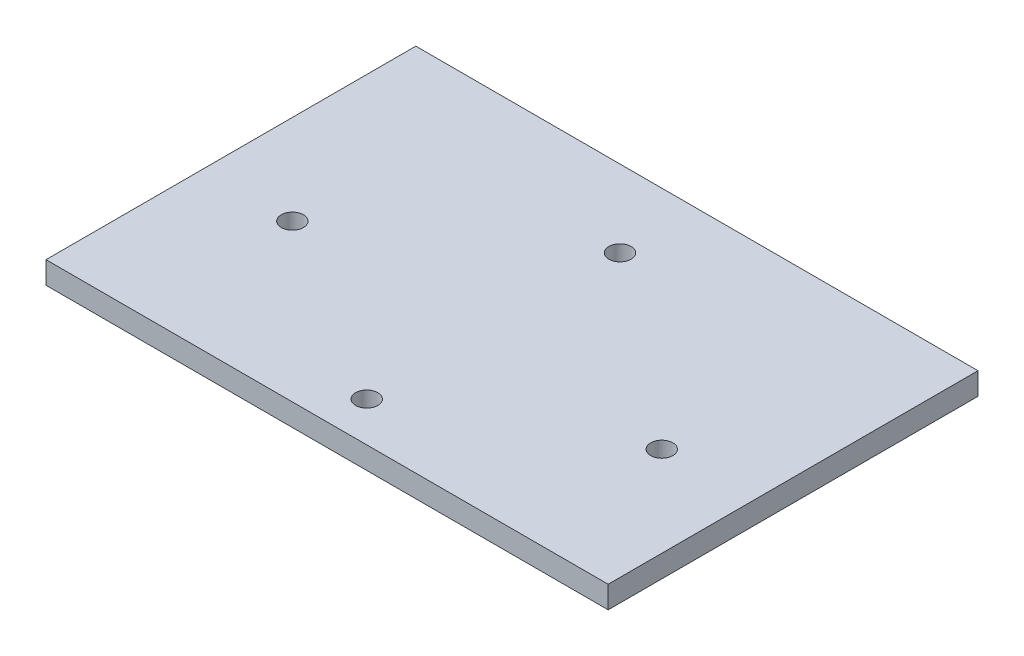
ISO-10303-21;
HEADER;
FILE_DESCRIPTION(('STEP AP214'),'2;1');
FILE_NAME('part.step','',(''),(''),'','','');
FILE_SCHEMA(('AUTOMOTIVE_DESIGN { 1 0 10303 214 1 1 1 1 }'));
ENDSEC;
DATA;
#1=APPLICATION_CONTEXT('core data for automotive mechanical design processes');
#2=APPLICATION_PROTOCOL_DEFINITION('international standard','automotive_design',2000,#1);
#3=PRODUCT_CONTEXT('',#1,'mechanical');
#4=PRODUCT('Part','Part','',(#3));
#5=PRODUCT_RELATED_PRODUCT_CATEGORY('part','',(#4));
#6=PRODUCT_DEFINITION_FORMATION('','',#4);
#7=PRODUCT_DEFINITION_CONTEXT('part definition',#1,'design');
#8=PRODUCT_DEFINITION('design','',#6,#7);
#9=PRODUCT_DEFINITION_SHAPE('','',#8);
#10=(LENGTH_UNIT() NAMED_UNIT(*) SI_UNIT(.MILLI.,.METRE.));
#11=(NAMED_UNIT(*) PLANE_ANGLE_UNIT() SI_UNIT($,.RADIAN.));
#12=(NAMED_UNIT(*) SI_UNIT($,.STERADIAN.) SOLID_ANGLE_UNIT());
#13=UNCERTAINTY_MEASURE_WITH_UNIT(LENGTH_MEASURE(1.E-05),#10,'distance_accuracy_value','');
#14=(GEOMETRIC_REPRESENTATION_CONTEXT(3) GLOBAL_UNCERTAINTY_ASSIGNED_CONTEXT((#13)) GLOBAL_UNIT_ASSIGNED_CONTEXT((#10,
#11,#12)) REPRESENTATION_CONTEXT('',''));
#15=CARTESIAN_POINT('',(0.,0.,0.));
#16=DIRECTION('',(0.,0.,1.));
#17=DIRECTION('',(1.,0.,0.));
#18=AXIS2_PLACEMENT_3D('',#15,#16,#17);
#19=CARTESIAN_POINT('',(0.,3.,0.));
#20=DIRECTION('',(0.,1.,0.));
#21=DIRECTION('',(0.,0.,1.));
#22=AXIS2_PLACEMENT_3D('',#19,#20,#21);
#23=PLANE('',#22);
#24=CARTESIAN_POINT('',(-25.8575432811212,3.,3.8343490298312));
#25=DIRECTION('',(0.,1.,0.));
#26=DIRECTION('',(0.,0.,1.));
#27=AXIS2_PLACEMENT_3D('',#24,#25,#26);
#28=CIRCLE('',#27,1.5);
#29=CARTESIAN_POINT('',(-25.8575432811212,3.,5.3343490298312));
#30=VERTEX_POINT('',#29);
#31=EDGE_CURVE('E120',#30,#30,#28,.T.);
#32=ORIENTED_EDGE('',*,*,#31,.F.);
#33=EDGE_LOOP('',(#32));
#34=FACE_BOUND('',#33,.T.);
#35=CARTESIAN_POINT('',(25.8166529266282,3.,5.56652926628196));
#36=DIRECTION('',(0.,1.,0.));
#37=DIRECTION('',(0.,0.,1.));
#38=AXIS2_PLACEMENT_3D('',#35,#36,#37);
#39=CIRCLE('',#38,1.5);
#40=CARTESIAN_POINT('',(25.8166529266282,3.,7.06652926628196));
#41=VERTEX_POINT('',#40);
#42=EDGE_CURVE('E99',#41,#41,#39,.T.);
#43=ORIENTED_EDGE('',*,*,#42,.F.);
#44=EDGE_LOOP('',(#43));
#45=FACE_BOUND('',#44,.T.);
#46=DIRECTION('',(0.,0.,-1.));
#47=VECTOR('',#46,1.);
#48=CARTESIAN_POINT('',(38.,3.,-25.));
#49=LINE('',#48,#47);
#50=CARTESIAN_POINT('',(38.,3.,25.));
#51=VERTEX_POINT('',#50);
#52=CARTESIAN_POINT('',(38.,3.,-25.));
#53=VERTEX_POINT('',#52);
#54=EDGE_CURVE('E84',#51,#53,#49,.T.);
#55=ORIENTED_EDGE('',*,*,#54,.T.);
#56=DIRECTION('',(-1.,0.,0.));
#57=VECTOR('',#56,1.);
#58=CARTESIAN_POINT('',(-38.,3.,-25.));
#59=LINE('',#58,#57);
#60=CARTESIAN_POINT('',(-38.,3.,-25.));
#61=VERTEX_POINT('',#60);
#62=EDGE_CURVE('E79',#53,#61,#59,.T.);
#63=ORIENTED_EDGE('',*,*,#62,.T.);
#64=DIRECTION('',(0.,0.,1.));
#65=VECTOR('',#64,1.);
#66=CARTESIAN_POINT('',(-38.,3.,-25.));
#67=LINE('',#66,#65);
#68=CARTESIAN_POINT('',(-38.,3.,25.));
#69=VERTEX_POINT('',#68);
#70=EDGE_CURVE('E82',#61,#69,#67,.T.);
#71=ORIENTED_EDGE('',*,*,#70,.T.);
#72=DIRECTION('',(1.,0.,0.));
#73=VECTOR('',#72,1.);
#74=CARTESIAN_POINT('',(-38.,3.,25.));
#75=LINE('',#74,#73);
#76=EDGE_CURVE('E49',#69,#51,#75,.T.);
#77=ORIENTED_EDGE('',*,*,#76,.T.);
#78=EDGE_LOOP('',(#55,#63,#71,#77));
#79=FACE_BOUND('',#78,.T.);
#80=CARTESIAN_POINT('',(0.,3.,-14.59901071723));
#81=DIRECTION('',(0.,1.,0.));
#82=DIRECTION('',(0.,0.,1.));
#83=AXIS2_PLACEMENT_3D('',#80,#81,#82);
#84=CIRCLE('',#83,1.5);
#85=CARTESIAN_POINT('',(0.,3.,-13.09901071723));
#86=VERTEX_POINT('',#85);
#87=EDGE_CURVE('E114',#86,#86,#84,.T.);
#88=ORIENTED_EDGE('',*,*,#87,.F.);
#89=EDGE_LOOP('',(#88));
#90=FACE_BOUND('',#89,.T.);
#91=CARTESIAN_POINT('',(0.,3.,19.640395713108));
#92=DIRECTION('',(0.,1.,0.));
#93=DIRECTION('',(0.,0.,1.));
#94=AXIS2_PLACEMENT_3D('',#91,#92,#93);
#95=CIRCLE('',#94,1.5);
#96=CARTESIAN_POINT('',(0.,3.,21.140395713108));
#97=VERTEX_POINT('',#96);
#98=EDGE_CURVE('E126',#97,#97,#95,.T.);
#99=ORIENTED_EDGE('',*,*,#98,.F.);
#100=EDGE_LOOP('',(#99));
#101=FACE_BOUND('',#100,.T.);
#102=ADVANCED_FACE('F32',(#34,#45,#79,#90,#101),#23,.T.);
#103=CARTESIAN_POINT('',(0.,0.,0.));
#104=DIRECTION('',(0.,1.,0.));
#105=DIRECTION('',(0.,0.,1.));
#106=AXIS2_PLACEMENT_3D('',#103,#104,#105);
#107=PLANE('',#106);
#108=DIRECTION('',(0.,0.,-1.));
#109=VECTOR('',#108,1.);
#110=CARTESIAN_POINT('',(38.,0.,-25.));
#111=LINE('',#110,#109);
#112=CARTESIAN_POINT('',(38.,0.,25.));
#113=VERTEX_POINT('',#112);
#114=CARTESIAN_POINT('',(38.,0.,-25.));
#115=VERTEX_POINT('',#114);
#116=EDGE_CURVE('E96',#113,#115,#111,.T.);
#117=ORIENTED_EDGE('',*,*,#116,.F.);
#118=DIRECTION('',(1.,0.,0.));
#119=VECTOR('',#118,1.);
#120=CARTESIAN_POINT('',(-38.,0.,25.));
#121=LINE('',#120,#119);
#122=CARTESIAN_POINT('',(-38.,0.,25.));
#123=VERTEX_POINT('',#122);
#124=EDGE_CURVE('E72',#123,#113,#121,.T.);
#125=ORIENTED_EDGE('',*,*,#124,.F.);
#126=DIRECTION('',(0.,0.,1.));
#127=VECTOR('',#126,1.);
#128=CARTESIAN_POINT('',(-38.,0.,-25.));
#129=LINE('',#128,#127);
#130=CARTESIAN_POINT('',(-38.,0.,-25.));
#131=VERTEX_POINT('',#130);
#132=EDGE_CURVE('E66',#131,#123,#129,.T.);
#133=ORIENTED_EDGE('',*,*,#132,.F.);
#134=DIRECTION('',(-1.,0.,0.));
#135=VECTOR('',#134,1.);
#136=CARTESIAN_POINT('',(-38.,0.,-25.));
#137=LINE('',#136,#135);
#138=EDGE_CURVE('E88',#115,#131,#137,.T.);
#139=ORIENTED_EDGE('',*,*,#138,.F.);
#140=EDGE_LOOP('',(#117,#125,#133,#139));
#141=FACE_BOUND('',#140,.T.);
#142=CARTESIAN_POINT('',(25.8166529266282,0.,5.56652926628196));
#143=DIRECTION('',(0.,1.,0.));
#144=DIRECTION('',(0.,0.,1.));
#145=AXIS2_PLACEMENT_3D('',#142,#143,#144);
#146=CIRCLE('',#145,1.5);
#147=CARTESIAN_POINT('',(25.8166529266282,0.,7.06652926628196));
#148=VERTEX_POINT('',#147);
#149=EDGE_CURVE('E111',#148,#148,#146,.T.);
#150=ORIENTED_EDGE('',*,*,#149,.T.);
#151=EDGE_LOOP('',(#150));
#152=FACE_BOUND('',#151,.T.);
#153=CARTESIAN_POINT('',(0.,0.,-14.59901071723));
#154=DIRECTION('',(0.,1.,0.));
#155=DIRECTION('',(0.,0.,1.));
#156=AXIS2_PLACEMENT_3D('',#153,#154,#155);
#157=CIRCLE('',#156,1.5);
#158=CARTESIAN_POINT('',(0.,0.,-13.09901071723));
#159=VERTEX_POINT('',#158);
#160=EDGE_CURVE('E117',#159,#159,#157,.T.);
#161=ORIENTED_EDGE('',*,*,#160,.T.);
#162=EDGE_LOOP('',(#161));
#163=FACE_BOUND('',#162,.T.);
#164=CARTESIAN_POINT('',(-25.8575432811212,0.,3.8343490298312));
#165=DIRECTION('',(0.,1.,0.));
#166=DIRECTION('',(0.,0.,1.));
#167=AXIS2_PLACEMENT_3D('',#164,#165,#166);
#168=CIRCLE('',#167,1.5);
#169=CARTESIAN_POINT('',(-25.8575432811212,0.,5.3343490298312));
#170=VERTEX_POINT('',#169);
#171=EDGE_CURVE('E123',#170,#170,#168,.T.);
#172=ORIENTED_EDGE('',*,*,#171,.T.);
#173=EDGE_LOOP('',(#172));
#174=FACE_BOUND('',#173,.T.);
#175=CARTESIAN_POINT('',(0.,0.,19.640395713108));
#176=DIRECTION('',(0.,1.,0.));
#177=DIRECTION('',(0.,0.,1.));
#178=AXIS2_PLACEMENT_3D('',#175,#176,#177);
#179=CIRCLE('',#178,1.5);
#180=CARTESIAN_POINT('',(0.,0.,21.140395713108));
#181=VERTEX_POINT('',#180);
#182=EDGE_CURVE('E129',#181,#181,#179,.T.);
#183=ORIENTED_EDGE('',*,*,#182,.T.);
#184=EDGE_LOOP('',(#183));
#185=FACE_BOUND('',#184,.T.);
#186=ADVANCED_FACE('F107',(#141,#152,#163,#174,#185),#107,.F.);
#187=CARTESIAN_POINT('',(38.,3.,-25.));
#188=DIRECTION('',(-1.,0.,0.));
#189=DIRECTION('',(0.,0.,1.));
#190=AXIS2_PLACEMENT_3D('',#187,#188,#189);
#191=PLANE('',#190);
#192=ORIENTED_EDGE('',*,*,#116,.T.);
#193=DIRECTION('',(0.,-1.,0.));
#194=VECTOR('',#193,1.);
#195=CARTESIAN_POINT('',(38.,3.,-25.));
#196=LINE('',#195,#194);
#197=EDGE_CURVE('E11',#53,#115,#196,.T.);
#198=ORIENTED_EDGE('',*,*,#197,.F.);
#199=ORIENTED_EDGE('',*,*,#54,.F.);
#200=DIRECTION('',(0.,-1.,0.));
#201=VECTOR('',#200,1.);
#202=CARTESIAN_POINT('',(38.,3.,25.));
#203=LINE('',#202,#201);
#204=EDGE_CURVE('E92',#51,#113,#203,.T.);
#205=ORIENTED_EDGE('',*,*,#204,.T.);
#206=EDGE_LOOP('',(#192,#198,#199,#205));
#207=FACE_BOUND('',#206,.T.);
#208=ADVANCED_FACE('F34',(#207),#191,.F.);
#209=CARTESIAN_POINT('',(-38.,3.,-25.));
#210=DIRECTION('',(0.,0.,1.));
#211=DIRECTION('',(1.,0.,0.));
#212=AXIS2_PLACEMENT_3D('',#209,#210,#211);
#213=PLANE('',#212);
#214=ORIENTED_EDGE('',*,*,#138,.T.);
#215=DIRECTION('',(0.,-1.,0.));
#216=VECTOR('',#215,1.);
#217=CARTESIAN_POINT('',(-38.,3.,-25.));
#218=LINE('',#217,#216);
#219=EDGE_CURVE('E41',#61,#131,#218,.T.);
#220=ORIENTED_EDGE('',*,*,#219,.F.);
#221=ORIENTED_EDGE('',*,*,#62,.F.);
#222=ORIENTED_EDGE('',*,*,#197,.T.);
#223=EDGE_LOOP('',(#214,#220,#221,#222));
#224=FACE_BOUND('',#223,.T.);
#225=ADVANCED_FACE('F87',(#224),#213,.F.);
#226=CARTESIAN_POINT('',(-38.,3.,-25.));
#227=DIRECTION('',(1.,0.,0.));
#228=DIRECTION('',(0.,0.,-1.));
#229=AXIS2_PLACEMENT_3D('',#226,#227,#228);
#230=PLANE('',#229);
#231=ORIENTED_EDGE('',*,*,#132,.T.);
#232=DIRECTION('',(0.,-1.,0.));
#233=VECTOR('',#232,1.);
#234=CARTESIAN_POINT('',(-38.,3.,25.));
#235=LINE('',#234,#233);
#236=EDGE_CURVE('E89',#69,#123,#235,.T.);
#237=ORIENTED_EDGE('',*,*,#236,.F.);
#238=ORIENTED_EDGE('',*,*,#70,.F.);
#239=ORIENTED_EDGE('',*,*,#219,.T.);
#240=EDGE_LOOP('',(#231,#237,#238,#239));
#241=FACE_BOUND('',#240,.T.);
#242=ADVANCED_FACE('F90',(#241),#230,.F.);
#243=CARTESIAN_POINT('',(-38.,3.,25.));
#244=DIRECTION('',(0.,0.,-1.));
#245=DIRECTION('',(-1.,0.,0.));
#246=AXIS2_PLACEMENT_3D('',#243,#244,#245);
#247=PLANE('',#246);
#248=ORIENTED_EDGE('',*,*,#124,.T.);
#249=ORIENTED_EDGE('',*,*,#204,.F.);
#250=ORIENTED_EDGE('',*,*,#76,.F.);
#251=ORIENTED_EDGE('',*,*,#236,.T.);
#252=EDGE_LOOP('',(#248,#249,#250,#251));
#253=FACE_BOUND('',#252,.T.);
#254=ADVANCED_FACE('F104',(#253),#247,.F.);
#255=CARTESIAN_POINT('',(25.8166529266282,3.,5.56652926628196));
#256=DIRECTION('',(0.,-1.,0.));
#257=DIRECTION('',(0.,0.,-1.));
#258=AXIS2_PLACEMENT_3D('',#255,#256,#257);
#259=CYLINDRICAL_SURFACE('',#258,1.5);
#260=ORIENTED_EDGE('',*,*,#42,.T.);
#261=EDGE_LOOP('',(#260));
#262=FACE_BOUND('',#261,.T.);
#263=ORIENTED_EDGE('',*,*,#149,.F.);
#264=EDGE_LOOP('',(#263));
#265=FACE_BOUND('',#264,.T.);
#266=ADVANCED_FACE('F148',(#262,#265),#259,.F.);
#267=CARTESIAN_POINT('',(0.,3.,-14.59901071723));
#268=DIRECTION('',(0.,-1.,0.));
#269=DIRECTION('',(0.,0.,-1.));
#270=AXIS2_PLACEMENT_3D('',#267,#268,#269);
#271=CYLINDRICAL_SURFACE('',#270,1.5);
#272=ORIENTED_EDGE('',*,*,#87,.T.);
#273=EDGE_LOOP('',(#272));
#274=FACE_BOUND('',#273,.T.);
#275=ORIENTED_EDGE('',*,*,#160,.F.);
#276=EDGE_LOOP('',(#275));
#277=FACE_BOUND('',#276,.T.);
#278=ADVANCED_FACE('F194',(#274,#277),#271,.F.);
#279=CARTESIAN_POINT('',(-25.8575432811212,3.,3.8343490298312));
#280=DIRECTION('',(0.,-1.,0.));
#281=DIRECTION('',(0.,0.,-1.));
#282=AXIS2_PLACEMENT_3D('',#279,#280,#281);
#283=CYLINDRICAL_SURFACE('',#282,1.5);
#284=ORIENTED_EDGE('',*,*,#31,.T.);
#285=EDGE_LOOP('',(#284));
#286=FACE_BOUND('',#285,.T.);
#287=ORIENTED_EDGE('',*,*,#171,.F.);
#288=EDGE_LOOP('',(#287));
#289=FACE_BOUND('',#288,.T.);
#290=ADVANCED_FACE('F202',(#286,#289),#283,.F.);
#291=CARTESIAN_POINT('',(0.,3.,19.640395713108));
#292=DIRECTION('',(0.,-1.,0.));
#293=DIRECTION('',(0.,0.,-1.));
#294=AXIS2_PLACEMENT_3D('',#291,#292,#293);
#295=CYLINDRICAL_SURFACE('',#294,1.5);
#296=ORIENTED_EDGE('',*,*,#98,.T.);
#297=EDGE_LOOP('',(#296));
#298=FACE_BOUND('',#297,.T.);
#299=ORIENTED_EDGE('',*,*,#182,.F.);
#300=EDGE_LOOP('',(#299));
#301=FACE_BOUND('',#300,.T.);
#302=ADVANCED_FACE('F135',(#298,#301),#295,.F.);
#303=CLOSED_SHELL('',(#102,#186,#208,#225,#242,#254,#266,#278,#290,#302));
#304=MANIFOLD_SOLID_BREP('B2',#303);
#305=ADVANCED_BREP_SHAPE_REPRESENTATION('',(#18,#304),#14);
#306=SHAPE_DEFINITION_REPRESENTATION(#9,#305);
ENDSEC;
END-ISO-10303-21;
